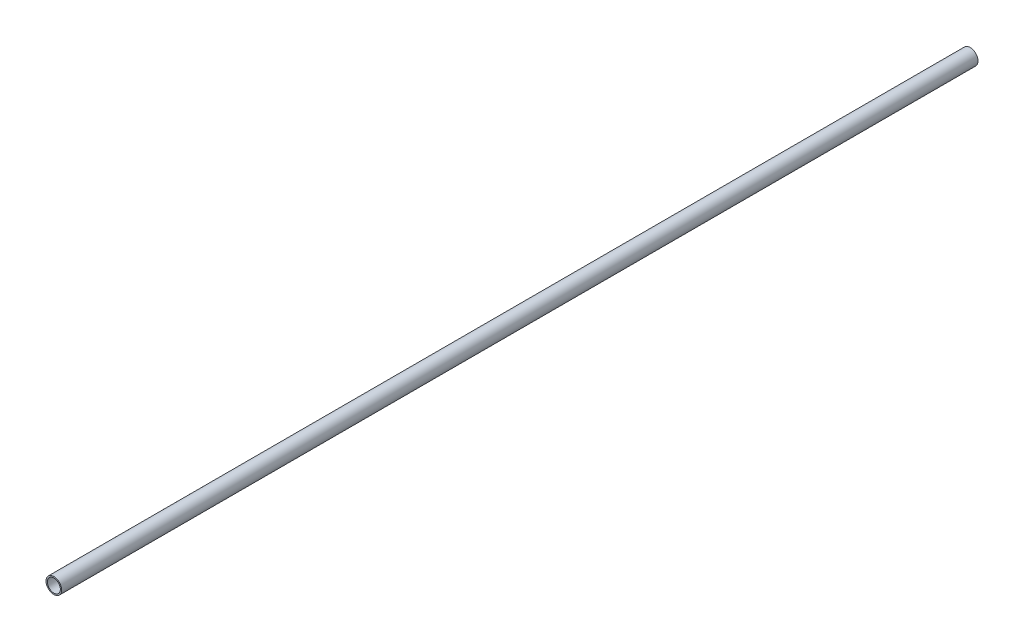
ISO-10303-21;
HEADER;
FILE_DESCRIPTION(('STEP AP214'),'2;1');
FILE_NAME('part.step','',(''),(''),'','','');
FILE_SCHEMA(('AUTOMOTIVE_DESIGN { 1 0 10303 214 1 1 1 1 }'));
ENDSEC;
DATA;
#1=APPLICATION_CONTEXT('core data for automotive mechanical design processes');
#2=APPLICATION_PROTOCOL_DEFINITION('international standard','automotive_design',2000,#1);
#3=PRODUCT_CONTEXT('',#1,'mechanical');
#4=PRODUCT('Part','Part','',(#3));
#5=PRODUCT_RELATED_PRODUCT_CATEGORY('part','',(#4));
#6=PRODUCT_DEFINITION_FORMATION('','',#4);
#7=PRODUCT_DEFINITION_CONTEXT('part definition',#1,'design');
#8=PRODUCT_DEFINITION('design','',#6,#7);
#9=PRODUCT_DEFINITION_SHAPE('','',#8);
#10=(LENGTH_UNIT() NAMED_UNIT(*) SI_UNIT(.MILLI.,.METRE.));
#11=(NAMED_UNIT(*) PLANE_ANGLE_UNIT() SI_UNIT($,.RADIAN.));
#12=(NAMED_UNIT(*) SI_UNIT($,.STERADIAN.) SOLID_ANGLE_UNIT());
#13=UNCERTAINTY_MEASURE_WITH_UNIT(LENGTH_MEASURE(1.E-05),#10,'distance_accuracy_value','');
#14=(GEOMETRIC_REPRESENTATION_CONTEXT(3) GLOBAL_UNCERTAINTY_ASSIGNED_CONTEXT((#13)) GLOBAL_UNIT_ASSIGNED_CONTEXT((#10,
#11,#12)) REPRESENTATION_CONTEXT('',''));
#15=CARTESIAN_POINT('',(0.,0.,0.));
#16=DIRECTION('',(0.,0.,1.));
#17=DIRECTION('',(1.,0.,0.));
#18=AXIS2_PLACEMENT_3D('',#15,#16,#17);
#19=CARTESIAN_POINT('',(0.,0.,2463.8));
#20=DIRECTION('',(0.,0.,1.));
#21=DIRECTION('',(1.,0.,0.));
#22=AXIS2_PLACEMENT_3D('',#19,#20,#21);
#23=PLANE('',#22);
#24=CARTESIAN_POINT('',(0.,0.,2463.8));
#25=DIRECTION('',(0.,0.,1.));
#26=DIRECTION('',(1.,0.,0.));
#27=AXIS2_PLACEMENT_3D('',#24,#25,#26);
#28=CIRCLE('',#27,21.082);
#29=CARTESIAN_POINT('',(21.082,0.,2463.8));
#30=VERTEX_POINT('',#29);
#31=EDGE_CURVE('E10',#30,#30,#28,.T.);
#32=ORIENTED_EDGE('',*,*,#31,.T.);
#33=EDGE_LOOP('',(#32));
#34=FACE_BOUND('',#33,.T.);
#35=CARTESIAN_POINT('',(0.,0.,2463.8));
#36=DIRECTION('',(0.,0.,1.));
#37=DIRECTION('',(1.,0.,0.));
#38=AXIS2_PLACEMENT_3D('',#35,#36,#37);
#39=CIRCLE('',#38,17.526);
#40=CARTESIAN_POINT('',(17.526,0.,2463.8));
#41=VERTEX_POINT('',#40);
#42=EDGE_CURVE('E41',#41,#41,#39,.T.);
#43=ORIENTED_EDGE('',*,*,#42,.F.);
#44=EDGE_LOOP('',(#43));
#45=FACE_BOUND('',#44,.T.);
#46=ADVANCED_FACE('F30',(#34,#45),#23,.T.);
#47=CARTESIAN_POINT('',(0.,0.,0.));
#48=DIRECTION('',(0.,0.,1.));
#49=DIRECTION('',(1.,0.,0.));
#50=AXIS2_PLACEMENT_3D('',#47,#48,#49);
#51=PLANE('',#50);
#52=CARTESIAN_POINT('',(0.,0.,0.));
#53=DIRECTION('',(0.,0.,1.));
#54=DIRECTION('',(1.,0.,0.));
#55=AXIS2_PLACEMENT_3D('',#52,#53,#54);
#56=CIRCLE('',#55,21.082);
#57=CARTESIAN_POINT('',(21.082,0.,0.));
#58=VERTEX_POINT('',#57);
#59=EDGE_CURVE('E34',#58,#58,#56,.T.);
#60=ORIENTED_EDGE('',*,*,#59,.F.);
#61=EDGE_LOOP('',(#60));
#62=FACE_BOUND('',#61,.T.);
#63=CARTESIAN_POINT('',(0.,0.,0.));
#64=DIRECTION('',(0.,0.,1.));
#65=DIRECTION('',(1.,0.,0.));
#66=AXIS2_PLACEMENT_3D('',#63,#64,#65);
#67=CIRCLE('',#66,17.526);
#68=CARTESIAN_POINT('',(17.526,0.,0.));
#69=VERTEX_POINT('',#68);
#70=EDGE_CURVE('E43',#69,#69,#67,.T.);
#71=ORIENTED_EDGE('',*,*,#70,.T.);
#72=EDGE_LOOP('',(#71));
#73=FACE_BOUND('',#72,.T.);
#74=ADVANCED_FACE('F53',(#62,#73),#51,.F.);
#75=CARTESIAN_POINT('',(0.,0.,2463.8));
#76=DIRECTION('',(0.,0.,-1.));
#77=DIRECTION('',(-1.,0.,0.));
#78=AXIS2_PLACEMENT_3D('',#75,#76,#77);
#79=CYLINDRICAL_SURFACE('',#78,21.082);
#80=ORIENTED_EDGE('',*,*,#31,.F.);
#81=EDGE_LOOP('',(#80));
#82=FACE_BOUND('',#81,.T.);
#83=ORIENTED_EDGE('',*,*,#59,.T.);
#84=EDGE_LOOP('',(#83));
#85=FACE_BOUND('',#84,.T.);
#86=ADVANCED_FACE('F32',(#82,#85),#79,.T.);
#87=CARTESIAN_POINT('',(0.,0.,2463.8));
#88=DIRECTION('',(0.,0.,-1.));
#89=DIRECTION('',(-1.,0.,0.));
#90=AXIS2_PLACEMENT_3D('',#87,#88,#89);
#91=CYLINDRICAL_SURFACE('',#90,17.526);
#92=ORIENTED_EDGE('',*,*,#42,.T.);
#93=EDGE_LOOP('',(#92));
#94=FACE_BOUND('',#93,.T.);
#95=ORIENTED_EDGE('',*,*,#70,.F.);
#96=EDGE_LOOP('',(#95));
#97=FACE_BOUND('',#96,.T.);
#98=ADVANCED_FACE('F49',(#94,#97),#91,.F.);
#99=CLOSED_SHELL('',(#46,#74,#86,#98));
#100=MANIFOLD_SOLID_BREP('B2',#99);
#101=ADVANCED_BREP_SHAPE_REPRESENTATION('',(#18,#100),#14);
#102=SHAPE_DEFINITION_REPRESENTATION(#9,#101);
ENDSEC;
END-ISO-10303-21;
